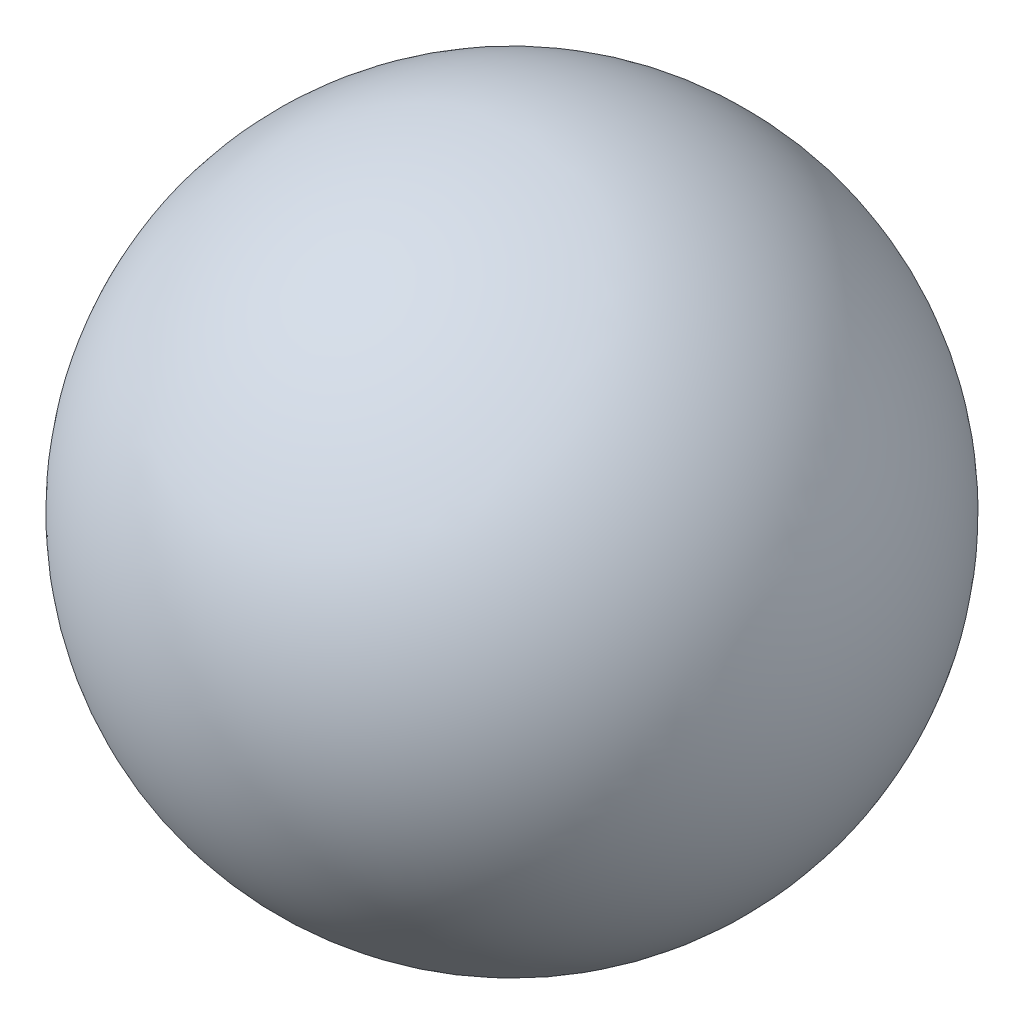
ISO-10303-21;
HEADER;
FILE_DESCRIPTION(('STEP AP214'),'2;1');
FILE_NAME('part.step','',(''),(''),'','','');
FILE_SCHEMA(('AUTOMOTIVE_DESIGN { 1 0 10303 214 1 1 1 1 }'));
ENDSEC;
DATA;
#1=APPLICATION_CONTEXT('core data for automotive mechanical design processes');
#2=APPLICATION_PROTOCOL_DEFINITION('international standard','automotive_design',2000,#1);
#3=PRODUCT_CONTEXT('',#1,'mechanical');
#4=PRODUCT('Part','Part','',(#3));
#5=PRODUCT_RELATED_PRODUCT_CATEGORY('part','',(#4));
#6=PRODUCT_DEFINITION_FORMATION('','',#4);
#7=PRODUCT_DEFINITION_CONTEXT('part definition',#1,'design');
#8=PRODUCT_DEFINITION('design','',#6,#7);
#9=PRODUCT_DEFINITION_SHAPE('','',#8);
#10=(LENGTH_UNIT() NAMED_UNIT(*) SI_UNIT(.MILLI.,.METRE.));
#11=(NAMED_UNIT(*) PLANE_ANGLE_UNIT() SI_UNIT($,.RADIAN.));
#12=(NAMED_UNIT(*) SI_UNIT($,.STERADIAN.) SOLID_ANGLE_UNIT());
#13=UNCERTAINTY_MEASURE_WITH_UNIT(LENGTH_MEASURE(1.E-05),#10,'distance_accuracy_value','');
#14=(GEOMETRIC_REPRESENTATION_CONTEXT(3) GLOBAL_UNCERTAINTY_ASSIGNED_CONTEXT((#13)) GLOBAL_UNIT_ASSIGNED_CONTEXT((#10,
#11,#12)) REPRESENTATION_CONTEXT('',''));
#15=CARTESIAN_POINT('',(0.,0.,0.));
#16=DIRECTION('',(0.,0.,1.));
#17=DIRECTION('',(1.,0.,0.));
#18=AXIS2_PLACEMENT_3D('',#15,#16,#17);
#19=CARTESIAN_POINT('',(0.,0.,0.));
#20=DIRECTION('',(-1.,0.,0.));
#21=DIRECTION('',(0.,1.,0.));
#22=AXIS2_PLACEMENT_3D('',#19,#20,#21);
#23=SPHERICAL_SURFACE('',#22,2.25);
#24=CARTESIAN_POINT('',(-2.25,0.,0.));
#25=VERTEX_POINT('',#24);
#26=VERTEX_LOOP('',#25);
#27=FACE_BOUND('',#26,.T.);
#28=ADVANCED_FACE('F35',(#27),#23,.T.);
#29=CLOSED_SHELL('',(#28));
#30=MANIFOLD_SOLID_BREP('B2',#29);
#31=ADVANCED_BREP_SHAPE_REPRESENTATION('',(#18,#30),#14);
#32=SHAPE_DEFINITION_REPRESENTATION(#9,#31);
ENDSEC;
END-ISO-10303-21;
